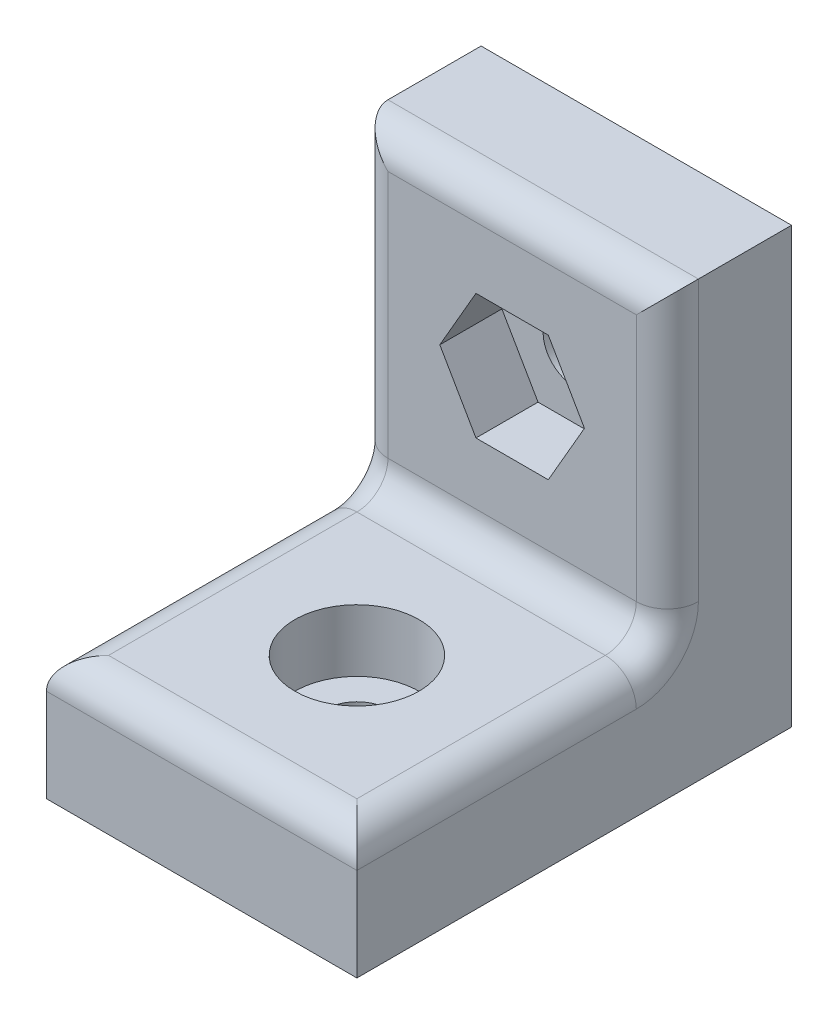
ISO-10303-21;
HEADER;
FILE_DESCRIPTION(('STEP AP214'),'2;1');
FILE_NAME('part.step','',(''),(''),'','','');
FILE_SCHEMA(('AUTOMOTIVE_DESIGN { 1 0 10303 214 1 1 1 1 }'));
ENDSEC;
DATA;
#1=APPLICATION_CONTEXT('core data for automotive mechanical design processes');
#2=APPLICATION_PROTOCOL_DEFINITION('international standard','automotive_design',2000,#1);
#3=PRODUCT_CONTEXT('',#1,'mechanical');
#4=PRODUCT('Part','Part','',(#3));
#5=PRODUCT_RELATED_PRODUCT_CATEGORY('part','',(#4));
#6=PRODUCT_DEFINITION_FORMATION('','',#4);
#7=PRODUCT_DEFINITION_CONTEXT('part definition',#1,'design');
#8=PRODUCT_DEFINITION('design','',#6,#7);
#9=PRODUCT_DEFINITION_SHAPE('','',#8);
#10=(LENGTH_UNIT() NAMED_UNIT(*) SI_UNIT(.MILLI.,.METRE.));
#11=(NAMED_UNIT(*) PLANE_ANGLE_UNIT() SI_UNIT($,.RADIAN.));
#12=(NAMED_UNIT(*) SI_UNIT($,.STERADIAN.) SOLID_ANGLE_UNIT());
#13=UNCERTAINTY_MEASURE_WITH_UNIT(LENGTH_MEASURE(1.E-05),#10,'distance_accuracy_value','');
#14=(GEOMETRIC_REPRESENTATION_CONTEXT(3) GLOBAL_UNCERTAINTY_ASSIGNED_CONTEXT((#13)) GLOBAL_UNIT_ASSIGNED_CONTEXT((#10,
#11,#12)) REPRESENTATION_CONTEXT('',''));
#15=CARTESIAN_POINT('',(0.,0.,0.));
#16=DIRECTION('',(0.,0.,1.));
#17=DIRECTION('',(1.,0.,0.));
#18=AXIS2_PLACEMENT_3D('',#15,#16,#17);
#19=CARTESIAN_POINT('',(0.,0.,9.));
#20=DIRECTION('',(0.,1.,0.));
#21=DIRECTION('',(0.,0.,1.));
#22=AXIS2_PLACEMENT_3D('',#19,#20,#21);
#23=CYLINDRICAL_SURFACE('',#22,1.);
#24=CARTESIAN_POINT('',(0.,0.,9.));
#25=DIRECTION('',(0.,1.,0.));
#26=DIRECTION('',(0.,0.,1.));
#27=AXIS2_PLACEMENT_3D('',#24,#25,#26);
#28=CIRCLE('',#27,1.);
#29=CARTESIAN_POINT('',(0.,0.,10.));
#30=VERTEX_POINT('',#29);
#31=EDGE_CURVE('E220',#30,#30,#28,.T.);
#32=ORIENTED_EDGE('',*,*,#31,.F.);
#33=EDGE_LOOP('',(#32));
#34=FACE_BOUND('',#33,.T.);
#35=CARTESIAN_POINT('',(0.,2.,9.));
#36=DIRECTION('',(0.,1.,0.));
#37=DIRECTION('',(0.,0.,1.));
#38=AXIS2_PLACEMENT_3D('',#35,#36,#37);
#39=CIRCLE('',#38,1.);
#40=CARTESIAN_POINT('',(0.,2.,10.));
#41=VERTEX_POINT('',#40);
#42=EDGE_CURVE('E44',#41,#41,#39,.F.);
#43=ORIENTED_EDGE('',*,*,#42,.F.);
#44=EDGE_LOOP('',(#43));
#45=FACE_BOUND('',#44,.T.);
#46=ADVANCED_FACE('F40',(#34,#45),#23,.F.);
#47=CARTESIAN_POINT('',(0.,9.,0.));
#48=DIRECTION('',(0.,0.,1.));
#49=DIRECTION('',(1.,0.,0.));
#50=AXIS2_PLACEMENT_3D('',#47,#48,#49);
#51=CYLINDRICAL_SURFACE('',#50,1.);
#52=CARTESIAN_POINT('',(0.,9.,0.));
#53=DIRECTION('',(0.,0.,1.));
#54=DIRECTION('',(1.,0.,0.));
#55=AXIS2_PLACEMENT_3D('',#52,#53,#54);
#56=CIRCLE('',#55,1.);
#57=CARTESIAN_POINT('',(1.,9.,0.));
#58=VERTEX_POINT('',#57);
#59=EDGE_CURVE('E224',#58,#58,#56,.T.);
#60=ORIENTED_EDGE('',*,*,#59,.F.);
#61=EDGE_LOOP('',(#60));
#62=FACE_BOUND('',#61,.T.);
#63=CARTESIAN_POINT('',(0.,9.,2.));
#64=DIRECTION('',(0.,0.,1.));
#65=DIRECTION('',(1.,0.,0.));
#66=AXIS2_PLACEMENT_3D('',#63,#64,#65);
#67=CIRCLE('',#66,1.);
#68=CARTESIAN_POINT('',(1.,9.,2.));
#69=VERTEX_POINT('',#68);
#70=EDGE_CURVE('E212',#69,#69,#67,.F.);
#71=ORIENTED_EDGE('',*,*,#70,.F.);
#72=EDGE_LOOP('',(#71));
#73=FACE_BOUND('',#72,.T.);
#74=ADVANCED_FACE('F317',(#62,#73),#51,.F.);
#75=CARTESIAN_POINT('',(-5.,14.,4.));
#76=DIRECTION('',(1.,0.,0.));
#77=DIRECTION('',(0.,1.,0.));
#78=AXIS2_PLACEMENT_3D('',#75,#76,#77);
#79=PLANE('',#78);
#80=CARTESIAN_POINT('',(-5.,5.,5.));
#81=DIRECTION('',(1.,0.,0.));
#82=DIRECTION('',(0.,1.,0.));
#83=AXIS2_PLACEMENT_3D('',#80,#81,#82);
#84=CIRCLE('',#83,2.);
#85=CARTESIAN_POINT('',(-5.,5.,3.));
#86=VERTEX_POINT('',#85);
#87=CARTESIAN_POINT('',(-5.,3.,5.));
#88=VERTEX_POINT('',#87);
#89=EDGE_CURVE('E274',#86,#88,#84,.F.);
#90=ORIENTED_EDGE('',*,*,#89,.F.);
#91=DIRECTION('',(0.,-1.,0.));
#92=VECTOR('',#91,1.);
#93=CARTESIAN_POINT('',(-5.,14.,3.));
#94=LINE('',#93,#92);
#95=CARTESIAN_POINT('',(-5.,14.,3.));
#96=VERTEX_POINT('',#95);
#97=EDGE_CURVE('E279',#86,#96,#94,.F.);
#98=ORIENTED_EDGE('',*,*,#97,.T.);
#99=DIRECTION('',(0.,0.,-1.));
#100=VECTOR('',#99,1.);
#101=CARTESIAN_POINT('',(-5.,14.,4.));
#102=LINE('',#101,#100);
#103=CARTESIAN_POINT('',(-5.,14.,0.));
#104=VERTEX_POINT('',#103);
#105=EDGE_CURVE('E247',#96,#104,#102,.T.);
#106=ORIENTED_EDGE('',*,*,#105,.T.);
#107=DIRECTION('',(0.,-1.,0.));
#108=VECTOR('',#107,1.);
#109=CARTESIAN_POINT('',(-5.,14.,0.));
#110=LINE('',#109,#108);
#111=CARTESIAN_POINT('',(-5.,0.,0.));
#112=VERTEX_POINT('',#111);
#113=EDGE_CURVE('E236',#104,#112,#110,.T.);
#114=ORIENTED_EDGE('',*,*,#113,.T.);
#115=DIRECTION('',(0.,0.,-1.));
#116=VECTOR('',#115,1.);
#117=CARTESIAN_POINT('',(-5.,0.,4.));
#118=LINE('',#117,#116);
#119=CARTESIAN_POINT('',(-5.,0.,14.));
#120=VERTEX_POINT('',#119);
#121=EDGE_CURVE('E254',#120,#112,#118,.T.);
#122=ORIENTED_EDGE('',*,*,#121,.F.);
#123=DIRECTION('',(0.,-1.,0.));
#124=VECTOR('',#123,1.);
#125=CARTESIAN_POINT('',(-5.,0.,14.));
#126=LINE('',#125,#124);
#127=CARTESIAN_POINT('',(-5.,3.,14.));
#128=VERTEX_POINT('',#127);
#129=EDGE_CURVE('E227',#128,#120,#126,.T.);
#130=ORIENTED_EDGE('',*,*,#129,.F.);
#131=DIRECTION('',(0.,0.,-1.));
#132=VECTOR('',#131,1.);
#133=CARTESIAN_POINT('',(-5.,3.,4.));
#134=LINE('',#133,#132);
#135=EDGE_CURVE('E277',#128,#88,#134,.T.);
#136=ORIENTED_EDGE('',*,*,#135,.T.);
#137=EDGE_LOOP('',(#90,#98,#106,#114,#122,#130,#136));
#138=FACE_BOUND('',#137,.T.);
#139=ADVANCED_FACE('F319',(#138),#79,.F.);
#140=CARTESIAN_POINT('',(-5.,0.,4.));
#141=DIRECTION('',(0.,1.,0.));
#142=DIRECTION('',(0.,0.,1.));
#143=AXIS2_PLACEMENT_3D('',#140,#141,#142);
#144=PLANE('',#143);
#145=ORIENTED_EDGE('',*,*,#31,.T.);
#146=EDGE_LOOP('',(#145));
#147=FACE_BOUND('',#146,.T.);
#148=DIRECTION('',(1.,0.,0.));
#149=VECTOR('',#148,1.);
#150=CARTESIAN_POINT('',(-5.,0.,0.));
#151=LINE('',#150,#149);
#152=CARTESIAN_POINT('',(5.,0.,0.));
#153=VERTEX_POINT('',#152);
#154=EDGE_CURVE('E239',#112,#153,#151,.T.);
#155=ORIENTED_EDGE('',*,*,#154,.T.);
#156=DIRECTION('',(0.,0.,-1.));
#157=VECTOR('',#156,1.);
#158=CARTESIAN_POINT('',(5.,0.,4.));
#159=LINE('',#158,#157);
#160=CARTESIAN_POINT('',(5.,0.,14.));
#161=VERTEX_POINT('',#160);
#162=EDGE_CURVE('E251',#161,#153,#159,.T.);
#163=ORIENTED_EDGE('',*,*,#162,.F.);
#164=DIRECTION('',(1.,0.,0.));
#165=VECTOR('',#164,1.);
#166=CARTESIAN_POINT('',(-5.,0.,14.));
#167=LINE('',#166,#165);
#168=EDGE_CURVE('E230',#120,#161,#167,.T.);
#169=ORIENTED_EDGE('',*,*,#168,.F.);
#170=ORIENTED_EDGE('',*,*,#121,.T.);
#171=EDGE_LOOP('',(#155,#163,#169,#170));
#172=FACE_BOUND('',#171,.T.);
#173=ADVANCED_FACE('F326',(#147,#172),#144,.F.);
#174=CARTESIAN_POINT('',(5.,14.,4.));
#175=DIRECTION('',(-1.,0.,0.));
#176=DIRECTION('',(0.,-1.,0.));
#177=AXIS2_PLACEMENT_3D('',#174,#175,#176);
#178=PLANE('',#177);
#179=DIRECTION('',(0.,0.,-1.));
#180=VECTOR('',#179,1.);
#181=CARTESIAN_POINT('',(5.,14.,4.));
#182=LINE('',#181,#180);
#183=CARTESIAN_POINT('',(5.,14.,3.));
#184=VERTEX_POINT('',#183);
#185=CARTESIAN_POINT('',(5.,14.,0.));
#186=VERTEX_POINT('',#185);
#187=EDGE_CURVE('E249',#184,#186,#182,.T.);
#188=ORIENTED_EDGE('',*,*,#187,.F.);
#189=DIRECTION('',(0.,1.,0.));
#190=VECTOR('',#189,1.);
#191=CARTESIAN_POINT('',(5.,4.,3.));
#192=LINE('',#191,#190);
#193=CARTESIAN_POINT('',(5.,5.,3.));
#194=VERTEX_POINT('',#193);
#195=EDGE_CURVE('E271',#184,#194,#192,.F.);
#196=ORIENTED_EDGE('',*,*,#195,.T.);
#197=CARTESIAN_POINT('',(5.,5.,5.));
#198=DIRECTION('',(-1.,0.,0.));
#199=DIRECTION('',(0.,-1.,0.));
#200=AXIS2_PLACEMENT_3D('',#197,#198,#199);
#201=CIRCLE('',#200,2.);
#202=CARTESIAN_POINT('',(5.,3.,5.));
#203=VERTEX_POINT('',#202);
#204=EDGE_CURVE('E268',#203,#194,#201,.F.);
#205=ORIENTED_EDGE('',*,*,#204,.F.);
#206=DIRECTION('',(0.,0.,-1.));
#207=VECTOR('',#206,1.);
#208=CARTESIAN_POINT('',(5.,3.,4.));
#209=LINE('',#208,#207);
#210=CARTESIAN_POINT('',(5.,3.,14.));
#211=VERTEX_POINT('',#210);
#212=EDGE_CURVE('E266',#203,#211,#209,.F.);
#213=ORIENTED_EDGE('',*,*,#212,.T.);
#214=DIRECTION('',(0.,1.,0.));
#215=VECTOR('',#214,1.);
#216=CARTESIAN_POINT('',(5.,0.,14.));
#217=LINE('',#216,#215);
#218=EDGE_CURVE('E233',#161,#211,#217,.T.);
#219=ORIENTED_EDGE('',*,*,#218,.F.);
#220=ORIENTED_EDGE('',*,*,#162,.T.);
#221=DIRECTION('',(0.,1.,0.));
#222=VECTOR('',#221,1.);
#223=CARTESIAN_POINT('',(5.,14.,0.));
#224=LINE('',#223,#222);
#225=EDGE_CURVE('E241',#153,#186,#224,.T.);
#226=ORIENTED_EDGE('',*,*,#225,.T.);
#227=EDGE_LOOP('',(#188,#196,#205,#213,#219,#220,#226));
#228=FACE_BOUND('',#227,.T.);
#229=ADVANCED_FACE('F353',(#228),#178,.F.);
#230=CARTESIAN_POINT('',(-5.,14.,4.));
#231=DIRECTION('',(0.,-1.,0.));
#232=DIRECTION('',(0.,0.,-1.));
#233=AXIS2_PLACEMENT_3D('',#230,#231,#232);
#234=PLANE('',#233);
#235=ORIENTED_EDGE('',*,*,#105,.F.);
#236=DIRECTION('',(-1.,0.,0.));
#237=VECTOR('',#236,1.);
#238=CARTESIAN_POINT('',(5.,14.,3.));
#239=LINE('',#238,#237);
#240=EDGE_CURVE('E281',#96,#184,#239,.F.);
#241=ORIENTED_EDGE('',*,*,#240,.T.);
#242=ORIENTED_EDGE('',*,*,#187,.T.);
#243=DIRECTION('',(-1.,0.,0.));
#244=VECTOR('',#243,1.);
#245=CARTESIAN_POINT('',(-5.,14.,0.));
#246=LINE('',#245,#244);
#247=EDGE_CURVE('E244',#186,#104,#246,.T.);
#248=ORIENTED_EDGE('',*,*,#247,.T.);
#249=EDGE_LOOP('',(#235,#241,#242,#248));
#250=FACE_BOUND('',#249,.T.);
#251=ADVANCED_FACE('F346',(#250),#234,.F.);
#252=CARTESIAN_POINT('',(0.,0.,4.));
#253=DIRECTION('',(0.,0.,1.));
#254=DIRECTION('',(1.,0.,0.));
#255=AXIS2_PLACEMENT_3D('',#252,#253,#254);
#256=PLANE('',#255);
#257=DIRECTION('',(1.,0.,0.));
#258=VECTOR('',#257,1.);
#259=CARTESIAN_POINT('',(-1.165,6.98216080918226,4.));
#260=LINE('',#259,#258);
#261=CARTESIAN_POINT('',(-1.165,6.98216080918226,4.));
#262=VERTEX_POINT('',#261);
#263=CARTESIAN_POINT('',(1.165,6.98216080918226,4.));
#264=VERTEX_POINT('',#263);
#265=EDGE_CURVE('E57',#262,#264,#260,.T.);
#266=ORIENTED_EDGE('',*,*,#265,.F.);
#267=DIRECTION('',(0.5,-0.866025403784439,0.));
#268=VECTOR('',#267,1.);
#269=CARTESIAN_POINT('',(-2.33,9.,4.));
#270=LINE('',#269,#268);
#271=CARTESIAN_POINT('',(-2.33,9.,4.));
#272=VERTEX_POINT('',#271);
#273=EDGE_CURVE('E183',#272,#262,#270,.T.);
#274=ORIENTED_EDGE('',*,*,#273,.F.);
#275=DIRECTION('',(-0.5,-0.866025403784439,0.));
#276=VECTOR('',#275,1.);
#277=CARTESIAN_POINT('',(-1.165,11.0178391908177,4.));
#278=LINE('',#277,#276);
#279=CARTESIAN_POINT('',(-1.165,11.0178391908177,4.));
#280=VERTEX_POINT('',#279);
#281=EDGE_CURVE('E186',#280,#272,#278,.T.);
#282=ORIENTED_EDGE('',*,*,#281,.F.);
#283=DIRECTION('',(-1.,0.,0.));
#284=VECTOR('',#283,1.);
#285=CARTESIAN_POINT('',(1.165,11.0178391908177,4.));
#286=LINE('',#285,#284);
#287=CARTESIAN_POINT('',(1.165,11.0178391908177,4.));
#288=VERTEX_POINT('',#287);
#289=EDGE_CURVE('E205',#288,#280,#286,.T.);
#290=ORIENTED_EDGE('',*,*,#289,.F.);
#291=DIRECTION('',(-0.5,0.866025403784439,0.));
#292=VECTOR('',#291,1.);
#293=CARTESIAN_POINT('',(2.33,9.,4.));
#294=LINE('',#293,#292);
#295=CARTESIAN_POINT('',(2.33,9.,4.));
#296=VERTEX_POINT('',#295);
#297=EDGE_CURVE('E202',#296,#288,#294,.T.);
#298=ORIENTED_EDGE('',*,*,#297,.F.);
#299=DIRECTION('',(0.5,0.866025403784439,0.));
#300=VECTOR('',#299,1.);
#301=CARTESIAN_POINT('',(1.165,6.98216080918226,4.));
#302=LINE('',#301,#300);
#303=EDGE_CURVE('E200',#264,#296,#302,.T.);
#304=ORIENTED_EDGE('',*,*,#303,.F.);
#305=EDGE_LOOP('',(#266,#274,#282,#290,#298,#304));
#306=FACE_BOUND('',#305,.T.);
#307=DIRECTION('',(0.,1.,0.));
#308=VECTOR('',#307,1.);
#309=CARTESIAN_POINT('',(4.,14.,4.));
#310=LINE('',#309,#308);
#311=CARTESIAN_POINT('',(4.,5.,4.));
#312=VERTEX_POINT('',#311);
#313=CARTESIAN_POINT('',(4.,13.,4.));
#314=VERTEX_POINT('',#313);
#315=EDGE_CURVE('E261',#312,#314,#310,.T.);
#316=ORIENTED_EDGE('',*,*,#315,.T.);
#317=DIRECTION('',(-1.,0.,0.));
#318=VECTOR('',#317,1.);
#319=CARTESIAN_POINT('',(-5.,13.,4.));
#320=LINE('',#319,#318);
#321=CARTESIAN_POINT('',(-4.,13.,4.));
#322=VERTEX_POINT('',#321);
#323=EDGE_CURVE('E264',#314,#322,#320,.T.);
#324=ORIENTED_EDGE('',*,*,#323,.T.);
#325=DIRECTION('',(0.,-1.,0.));
#326=VECTOR('',#325,1.);
#327=CARTESIAN_POINT('',(-4.,4.,4.));
#328=LINE('',#327,#326);
#329=CARTESIAN_POINT('',(-4.,5.,4.));
#330=VERTEX_POINT('',#329);
#331=EDGE_CURVE('E259',#322,#330,#328,.T.);
#332=ORIENTED_EDGE('',*,*,#331,.T.);
#333=DIRECTION('',(-1.,0.,0.));
#334=VECTOR('',#333,1.);
#335=CARTESIAN_POINT('',(0.,5.,4.));
#336=LINE('',#335,#334);
#337=EDGE_CURVE('E257',#330,#312,#336,.F.);
#338=ORIENTED_EDGE('',*,*,#337,.T.);
#339=EDGE_LOOP('',(#316,#324,#332,#338));
#340=FACE_BOUND('',#339,.T.);
#341=ADVANCED_FACE('F343',(#306,#340),#256,.T.);
#342=CARTESIAN_POINT('',(0.,0.,0.));
#343=DIRECTION('',(0.,0.,1.));
#344=DIRECTION('',(1.,0.,0.));
#345=AXIS2_PLACEMENT_3D('',#342,#343,#344);
#346=PLANE('',#345);
#347=ORIENTED_EDGE('',*,*,#59,.T.);
#348=EDGE_LOOP('',(#347));
#349=FACE_BOUND('',#348,.T.);
#350=ORIENTED_EDGE('',*,*,#113,.F.);
#351=ORIENTED_EDGE('',*,*,#247,.F.);
#352=ORIENTED_EDGE('',*,*,#225,.F.);
#353=ORIENTED_EDGE('',*,*,#154,.F.);
#354=EDGE_LOOP('',(#350,#351,#352,#353));
#355=FACE_BOUND('',#354,.T.);
#356=ADVANCED_FACE('F341',(#349,#355),#346,.F.);
#357=CARTESIAN_POINT('',(-5.,4.,14.));
#358=DIRECTION('',(0.,-1.,0.));
#359=DIRECTION('',(0.,0.,-1.));
#360=AXIS2_PLACEMENT_3D('',#357,#358,#359);
#361=PLANE('',#360);
#362=CARTESIAN_POINT('',(0.,4.,9.));
#363=DIRECTION('',(0.,1.,0.));
#364=DIRECTION('',(0.,0.,1.));
#365=AXIS2_PLACEMENT_3D('',#362,#363,#364);
#366=CIRCLE('',#365,2.);
#367=CARTESIAN_POINT('',(0.,4.,11.));
#368=VERTEX_POINT('',#367);
#369=EDGE_CURVE('E189',#368,#368,#366,.T.);
#370=ORIENTED_EDGE('',*,*,#369,.F.);
#371=EDGE_LOOP('',(#370));
#372=FACE_BOUND('',#371,.T.);
#373=DIRECTION('',(0.,0.,-1.));
#374=VECTOR('',#373,1.);
#375=CARTESIAN_POINT('',(-4.,4.,14.));
#376=LINE('',#375,#374);
#377=CARTESIAN_POINT('',(-4.,4.,5.));
#378=VERTEX_POINT('',#377);
#379=CARTESIAN_POINT('',(-4.,4.,13.));
#380=VERTEX_POINT('',#379);
#381=EDGE_CURVE('E287',#378,#380,#376,.F.);
#382=ORIENTED_EDGE('',*,*,#381,.T.);
#383=DIRECTION('',(-1.,0.,0.));
#384=VECTOR('',#383,1.);
#385=CARTESIAN_POINT('',(-5.,4.,13.));
#386=LINE('',#385,#384);
#387=CARTESIAN_POINT('',(4.,4.,13.));
#388=VERTEX_POINT('',#387);
#389=EDGE_CURVE('E12',#380,#388,#386,.F.);
#390=ORIENTED_EDGE('',*,*,#389,.T.);
#391=DIRECTION('',(0.,0.,-1.));
#392=VECTOR('',#391,1.);
#393=CARTESIAN_POINT('',(4.,4.,14.));
#394=LINE('',#393,#392);
#395=CARTESIAN_POINT('',(4.,4.,5.));
#396=VERTEX_POINT('',#395);
#397=EDGE_CURVE('E49',#388,#396,#394,.T.);
#398=ORIENTED_EDGE('',*,*,#397,.T.);
#399=DIRECTION('',(-1.,0.,0.));
#400=VECTOR('',#399,1.);
#401=CARTESIAN_POINT('',(-5.,4.,5.));
#402=LINE('',#401,#400);
#403=EDGE_CURVE('E285',#396,#378,#402,.T.);
#404=ORIENTED_EDGE('',*,*,#403,.T.);
#405=EDGE_LOOP('',(#382,#390,#398,#404));
#406=FACE_BOUND('',#405,.T.);
#407=ADVANCED_FACE('F337',(#372,#406),#361,.F.);
#408=CARTESIAN_POINT('',(0.,0.,14.));
#409=DIRECTION('',(0.,0.,-1.));
#410=DIRECTION('',(-1.,0.,0.));
#411=AXIS2_PLACEMENT_3D('',#408,#409,#410);
#412=PLANE('',#411);
#413=ORIENTED_EDGE('',*,*,#218,.T.);
#414=DIRECTION('',(-1.,0.,0.));
#415=VECTOR('',#414,1.);
#416=CARTESIAN_POINT('',(0.,3.,14.));
#417=LINE('',#416,#415);
#418=EDGE_CURVE('E283',#211,#128,#417,.T.);
#419=ORIENTED_EDGE('',*,*,#418,.T.);
#420=ORIENTED_EDGE('',*,*,#129,.T.);
#421=ORIENTED_EDGE('',*,*,#168,.T.);
#422=EDGE_LOOP('',(#413,#419,#420,#421));
#423=FACE_BOUND('',#422,.T.);
#424=ADVANCED_FACE('F334',(#423),#412,.F.);
#425=CARTESIAN_POINT('',(-4.,3.,4.));
#426=DIRECTION('',(0.,0.,-1.));
#427=DIRECTION('',(-1.,0.,0.));
#428=AXIS2_PLACEMENT_3D('',#425,#426,#427);
#429=CYLINDRICAL_SURFACE('',#428,1.);
#430=CARTESIAN_POINT('',(-4.,3.,5.));
#431=DIRECTION('',(0.,0.,-1.));
#432=DIRECTION('',(-1.,0.,0.));
#433=AXIS2_PLACEMENT_3D('',#430,#431,#432);
#434=CIRCLE('',#433,1.);
#435=EDGE_CURVE('E310',#88,#378,#434,.T.);
#436=ORIENTED_EDGE('',*,*,#435,.F.);
#437=ORIENTED_EDGE('',*,*,#135,.F.);
#438=CARTESIAN_POINT('',(-4.,3.,13.));
#439=DIRECTION('',(-0.707106781186547,0.,-0.707106781186547));
#440=DIRECTION('',(0.707106781186547,0.,-0.707106781186547));
#441=AXIS2_PLACEMENT_3D('',#438,#439,#440);
#442=ELLIPSE('',#441,1.41421356237309,1.);
#443=EDGE_CURVE('E228',#380,#128,#442,.F.);
#444=ORIENTED_EDGE('',*,*,#443,.F.);
#445=ORIENTED_EDGE('',*,*,#381,.F.);
#446=EDGE_LOOP('',(#436,#437,#444,#445));
#447=FACE_BOUND('',#446,.T.);
#448=ADVANCED_FACE('F42',(#447),#429,.T.);
#449=CARTESIAN_POINT('',(0.,3.,13.));
#450=DIRECTION('',(-1.,0.,0.));
#451=DIRECTION('',(0.,0.,1.));
#452=AXIS2_PLACEMENT_3D('',#449,#450,#451);
#453=CYLINDRICAL_SURFACE('',#452,1.);
#454=ORIENTED_EDGE('',*,*,#443,.T.);
#455=ORIENTED_EDGE('',*,*,#418,.F.);
#456=CARTESIAN_POINT('',(4.,3.,13.));
#457=DIRECTION('',(0.707106781186547,0.,-0.707106781186547));
#458=DIRECTION('',(-0.707106781186547,0.,-0.707106781186547));
#459=AXIS2_PLACEMENT_3D('',#456,#457,#458);
#460=ELLIPSE('',#459,1.41421356237309,1.);
#461=EDGE_CURVE('E308',#388,#211,#460,.T.);
#462=ORIENTED_EDGE('',*,*,#461,.F.);
#463=ORIENTED_EDGE('',*,*,#389,.F.);
#464=EDGE_LOOP('',(#454,#455,#462,#463));
#465=FACE_BOUND('',#464,.T.);
#466=ADVANCED_FACE('F386',(#465),#453,.T.);
#467=CARTESIAN_POINT('',(-4.,5.,5.));
#468=DIRECTION('',(1.,0.,0.));
#469=DIRECTION('',(0.,1.,0.));
#470=AXIS2_PLACEMENT_3D('',#467,#468,#469);
#471=TOROIDAL_SURFACE('',#470,2.,1.);
#472=ORIENTED_EDGE('',*,*,#89,.T.);
#473=ORIENTED_EDGE('',*,*,#435,.T.);
#474=CARTESIAN_POINT('',(-4.,5.,5.));
#475=DIRECTION('',(1.,0.,0.));
#476=DIRECTION('',(0.,1.,0.));
#477=AXIS2_PLACEMENT_3D('',#474,#475,#476);
#478=CIRCLE('',#477,1.);
#479=EDGE_CURVE('E305',#330,#378,#478,.F.);
#480=ORIENTED_EDGE('',*,*,#479,.F.);
#481=CARTESIAN_POINT('',(-4.,5.,3.));
#482=DIRECTION('',(0.,-1.,0.));
#483=DIRECTION('',(0.,0.,-1.));
#484=AXIS2_PLACEMENT_3D('',#481,#482,#483);
#485=CIRCLE('',#484,1.);
#486=EDGE_CURVE('E302',#86,#330,#485,.F.);
#487=ORIENTED_EDGE('',*,*,#486,.F.);
#488=EDGE_LOOP('',(#472,#473,#480,#487));
#489=FACE_BOUND('',#488,.T.);
#490=ADVANCED_FACE('F384',(#489),#471,.T.);
#491=CARTESIAN_POINT('',(4.,3.,14.));
#492=DIRECTION('',(0.,0.,-1.));
#493=DIRECTION('',(-1.,0.,0.));
#494=AXIS2_PLACEMENT_3D('',#491,#492,#493);
#495=CYLINDRICAL_SURFACE('',#494,1.);
#496=ORIENTED_EDGE('',*,*,#461,.T.);
#497=ORIENTED_EDGE('',*,*,#212,.F.);
#498=CARTESIAN_POINT('',(4.,3.,5.));
#499=DIRECTION('',(0.,0.,-1.));
#500=DIRECTION('',(-1.,0.,0.));
#501=AXIS2_PLACEMENT_3D('',#498,#499,#500);
#502=CIRCLE('',#501,1.);
#503=EDGE_CURVE('E299',#396,#203,#502,.T.);
#504=ORIENTED_EDGE('',*,*,#503,.F.);
#505=ORIENTED_EDGE('',*,*,#397,.F.);
#506=EDGE_LOOP('',(#496,#497,#504,#505));
#507=FACE_BOUND('',#506,.T.);
#508=ADVANCED_FACE('F380',(#507),#495,.T.);
#509=CARTESIAN_POINT('',(-5.,5.,5.));
#510=DIRECTION('',(-1.,0.,0.));
#511=DIRECTION('',(0.,0.,1.));
#512=AXIS2_PLACEMENT_3D('',#509,#510,#511);
#513=CYLINDRICAL_SURFACE('',#512,1.);
#514=ORIENTED_EDGE('',*,*,#479,.T.);
#515=ORIENTED_EDGE('',*,*,#403,.F.);
#516=CARTESIAN_POINT('',(4.,5.,5.));
#517=DIRECTION('',(-1.,0.,0.));
#518=DIRECTION('',(0.,-1.,0.));
#519=AXIS2_PLACEMENT_3D('',#516,#517,#518);
#520=CIRCLE('',#519,1.);
#521=EDGE_CURVE('E296',#312,#396,#520,.T.);
#522=ORIENTED_EDGE('',*,*,#521,.F.);
#523=ORIENTED_EDGE('',*,*,#337,.F.);
#524=EDGE_LOOP('',(#514,#515,#522,#523));
#525=FACE_BOUND('',#524,.T.);
#526=ADVANCED_FACE('F376',(#525),#513,.F.);
#527=CARTESIAN_POINT('',(-4.,0.,3.));
#528=DIRECTION('',(0.,1.,0.));
#529=DIRECTION('',(-1.,0.,0.));
#530=AXIS2_PLACEMENT_3D('',#527,#528,#529);
#531=CYLINDRICAL_SURFACE('',#530,1.);
#532=ORIENTED_EDGE('',*,*,#486,.T.);
#533=ORIENTED_EDGE('',*,*,#331,.F.);
#534=CARTESIAN_POINT('',(-4.,13.,3.));
#535=DIRECTION('',(0.707106781186547,0.707106781186548,0.));
#536=DIRECTION('',(0.707106781186548,-0.707106781186547,0.));
#537=AXIS2_PLACEMENT_3D('',#534,#535,#536);
#538=ELLIPSE('',#537,1.4142135623731,1.);
#539=EDGE_CURVE('E293',#96,#322,#538,.T.);
#540=ORIENTED_EDGE('',*,*,#539,.F.);
#541=ORIENTED_EDGE('',*,*,#97,.F.);
#542=EDGE_LOOP('',(#532,#533,#540,#541));
#543=FACE_BOUND('',#542,.T.);
#544=ADVANCED_FACE('F372',(#543),#531,.T.);
#545=CARTESIAN_POINT('',(4.,5.,5.));
#546=DIRECTION('',(-1.,0.,0.));
#547=DIRECTION('',(0.,-1.,0.));
#548=AXIS2_PLACEMENT_3D('',#545,#546,#547);
#549=TOROIDAL_SURFACE('',#548,2.,1.);
#550=ORIENTED_EDGE('',*,*,#503,.T.);
#551=ORIENTED_EDGE('',*,*,#204,.T.);
#552=CARTESIAN_POINT('',(4.,5.,3.));
#553=DIRECTION('',(0.,-1.,0.));
#554=DIRECTION('',(0.,0.,-1.));
#555=AXIS2_PLACEMENT_3D('',#552,#553,#554);
#556=CIRCLE('',#555,1.);
#557=EDGE_CURVE('E291',#312,#194,#556,.F.);
#558=ORIENTED_EDGE('',*,*,#557,.F.);
#559=ORIENTED_EDGE('',*,*,#521,.T.);
#560=EDGE_LOOP('',(#550,#551,#558,#559));
#561=FACE_BOUND('',#560,.T.);
#562=ADVANCED_FACE('F368',(#561),#549,.T.);
#563=CARTESIAN_POINT('',(0.,13.,3.));
#564=DIRECTION('',(1.,0.,0.));
#565=DIRECTION('',(0.,0.,-1.));
#566=AXIS2_PLACEMENT_3D('',#563,#564,#565);
#567=CYLINDRICAL_SURFACE('',#566,1.);
#568=ORIENTED_EDGE('',*,*,#539,.T.);
#569=ORIENTED_EDGE('',*,*,#323,.F.);
#570=CARTESIAN_POINT('',(4.,13.,3.));
#571=DIRECTION('',(0.707106781186548,-0.707106781186547,0.));
#572=DIRECTION('',(0.707106781186547,0.707106781186548,0.));
#573=AXIS2_PLACEMENT_3D('',#570,#571,#572);
#574=ELLIPSE('',#573,1.41421356237309,1.);
#575=EDGE_CURVE('E223',#184,#314,#574,.T.);
#576=ORIENTED_EDGE('',*,*,#575,.F.);
#577=ORIENTED_EDGE('',*,*,#240,.F.);
#578=EDGE_LOOP('',(#568,#569,#576,#577));
#579=FACE_BOUND('',#578,.T.);
#580=ADVANCED_FACE('F364',(#579),#567,.T.);
#581=CARTESIAN_POINT('',(4.,0.,3.));
#582=DIRECTION('',(0.,-1.,0.));
#583=DIRECTION('',(1.,0.,0.));
#584=AXIS2_PLACEMENT_3D('',#581,#582,#583);
#585=CYLINDRICAL_SURFACE('',#584,1.);
#586=ORIENTED_EDGE('',*,*,#557,.T.);
#587=ORIENTED_EDGE('',*,*,#195,.F.);
#588=ORIENTED_EDGE('',*,*,#575,.T.);
#589=ORIENTED_EDGE('',*,*,#315,.F.);
#590=EDGE_LOOP('',(#586,#587,#588,#589));
#591=FACE_BOUND('',#590,.T.);
#592=ADVANCED_FACE('F361',(#591),#585,.T.);
#593=CARTESIAN_POINT('',(0.,0.,2.));
#594=DIRECTION('',(0.,0.,1.));
#595=DIRECTION('',(1.,0.,0.));
#596=AXIS2_PLACEMENT_3D('',#593,#594,#595);
#597=PLANE('',#596);
#598=DIRECTION('',(1.,0.,0.));
#599=VECTOR('',#598,1.);
#600=CARTESIAN_POINT('',(-1.165,6.98216080918226,2.));
#601=LINE('',#600,#599);
#602=CARTESIAN_POINT('',(-1.165,6.98216080918226,2.));
#603=VERTEX_POINT('',#602);
#604=CARTESIAN_POINT('',(1.165,6.98216080918226,2.));
#605=VERTEX_POINT('',#604);
#606=EDGE_CURVE('E163',#603,#605,#601,.T.);
#607=ORIENTED_EDGE('',*,*,#606,.T.);
#608=DIRECTION('',(0.5,0.866025403784439,0.));
#609=VECTOR('',#608,1.);
#610=CARTESIAN_POINT('',(1.165,6.98216080918226,2.));
#611=LINE('',#610,#609);
#612=CARTESIAN_POINT('',(2.33,9.,2.));
#613=VERTEX_POINT('',#612);
#614=EDGE_CURVE('E172',#605,#613,#611,.T.);
#615=ORIENTED_EDGE('',*,*,#614,.T.);
#616=DIRECTION('',(-0.5,0.866025403784439,0.));
#617=VECTOR('',#616,1.);
#618=CARTESIAN_POINT('',(2.33,9.,2.));
#619=LINE('',#618,#617);
#620=CARTESIAN_POINT('',(1.165,11.0178391908177,2.));
#621=VERTEX_POINT('',#620);
#622=EDGE_CURVE('E177',#613,#621,#619,.T.);
#623=ORIENTED_EDGE('',*,*,#622,.T.);
#624=DIRECTION('',(-1.,0.,0.));
#625=VECTOR('',#624,1.);
#626=CARTESIAN_POINT('',(1.165,11.0178391908177,2.));
#627=LINE('',#626,#625);
#628=CARTESIAN_POINT('',(-1.165,11.0178391908177,2.));
#629=VERTEX_POINT('',#628);
#630=EDGE_CURVE('E193',#621,#629,#627,.T.);
#631=ORIENTED_EDGE('',*,*,#630,.T.);
#632=DIRECTION('',(-0.5,-0.866025403784439,0.));
#633=VECTOR('',#632,1.);
#634=CARTESIAN_POINT('',(-1.165,11.0178391908177,2.));
#635=LINE('',#634,#633);
#636=CARTESIAN_POINT('',(-2.33,9.,2.));
#637=VERTEX_POINT('',#636);
#638=EDGE_CURVE('E196',#629,#637,#635,.T.);
#639=ORIENTED_EDGE('',*,*,#638,.T.);
#640=DIRECTION('',(0.5,-0.866025403784439,0.));
#641=VECTOR('',#640,1.);
#642=CARTESIAN_POINT('',(-2.33,9.,2.));
#643=LINE('',#642,#641);
#644=EDGE_CURVE('E169',#637,#603,#643,.T.);
#645=ORIENTED_EDGE('',*,*,#644,.T.);
#646=EDGE_LOOP('',(#607,#615,#623,#631,#639,#645));
#647=FACE_BOUND('',#646,.T.);
#648=ORIENTED_EDGE('',*,*,#70,.T.);
#649=EDGE_LOOP('',(#648));
#650=FACE_BOUND('',#649,.T.);
#651=ADVANCED_FACE('F179',(#647,#650),#597,.T.);
#652=CARTESIAN_POINT('',(-1.165,6.98216080918226,2.));
#653=DIRECTION('',(0.,-1.,0.));
#654=DIRECTION('',(0.,0.,-1.));
#655=AXIS2_PLACEMENT_3D('',#652,#653,#654);
#656=PLANE('',#655);
#657=ORIENTED_EDGE('',*,*,#265,.T.);
#658=DIRECTION('',(0.,0.,1.));
#659=VECTOR('',#658,1.);
#660=CARTESIAN_POINT('',(1.165,6.98216080918226,2.));
#661=LINE('',#660,#659);
#662=EDGE_CURVE('E159',#605,#264,#661,.T.);
#663=ORIENTED_EDGE('',*,*,#662,.F.);
#664=ORIENTED_EDGE('',*,*,#606,.F.);
#665=DIRECTION('',(0.,0.,1.));
#666=VECTOR('',#665,1.);
#667=CARTESIAN_POINT('',(-1.165,6.98216080918226,2.));
#668=LINE('',#667,#666);
#669=EDGE_CURVE('E210',#603,#262,#668,.T.);
#670=ORIENTED_EDGE('',*,*,#669,.T.);
#671=EDGE_LOOP('',(#657,#663,#664,#670));
#672=FACE_BOUND('',#671,.T.);
#673=ADVANCED_FACE('F161',(#672),#656,.F.);
#674=CARTESIAN_POINT('',(-2.33,9.,2.));
#675=DIRECTION('',(-0.866025403784439,-0.5,0.));
#676=DIRECTION('',(0.5,-0.866025403784439,0.));
#677=AXIS2_PLACEMENT_3D('',#674,#675,#676);
#678=PLANE('',#677);
#679=ORIENTED_EDGE('',*,*,#273,.T.);
#680=ORIENTED_EDGE('',*,*,#669,.F.);
#681=ORIENTED_EDGE('',*,*,#644,.F.);
#682=DIRECTION('',(0.,0.,1.));
#683=VECTOR('',#682,1.);
#684=CARTESIAN_POINT('',(-2.33,9.,2.));
#685=LINE('',#684,#683);
#686=EDGE_CURVE('E213',#637,#272,#685,.T.);
#687=ORIENTED_EDGE('',*,*,#686,.T.);
#688=EDGE_LOOP('',(#679,#680,#681,#687));
#689=FACE_BOUND('',#688,.T.);
#690=ADVANCED_FACE('F549',(#689),#678,.F.);
#691=CARTESIAN_POINT('',(-1.165,11.0178391908177,2.));
#692=DIRECTION('',(-0.866025403784439,0.5,0.));
#693=DIRECTION('',(-0.5,-0.866025403784439,0.));
#694=AXIS2_PLACEMENT_3D('',#691,#692,#693);
#695=PLANE('',#694);
#696=ORIENTED_EDGE('',*,*,#281,.T.);
#697=ORIENTED_EDGE('',*,*,#686,.F.);
#698=ORIENTED_EDGE('',*,*,#638,.F.);
#699=DIRECTION('',(0.,0.,1.));
#700=VECTOR('',#699,1.);
#701=CARTESIAN_POINT('',(-1.165,11.0178391908177,2.));
#702=LINE('',#701,#700);
#703=EDGE_CURVE('E215',#629,#280,#702,.T.);
#704=ORIENTED_EDGE('',*,*,#703,.T.);
#705=EDGE_LOOP('',(#696,#697,#698,#704));
#706=FACE_BOUND('',#705,.T.);
#707=ADVANCED_FACE('F556',(#706),#695,.F.);
#708=CARTESIAN_POINT('',(1.165,11.0178391908177,2.));
#709=DIRECTION('',(0.,1.,0.));
#710=DIRECTION('',(0.,0.,1.));
#711=AXIS2_PLACEMENT_3D('',#708,#709,#710);
#712=PLANE('',#711);
#713=ORIENTED_EDGE('',*,*,#289,.T.);
#714=ORIENTED_EDGE('',*,*,#703,.F.);
#715=ORIENTED_EDGE('',*,*,#630,.F.);
#716=DIRECTION('',(0.,0.,1.));
#717=VECTOR('',#716,1.);
#718=CARTESIAN_POINT('',(1.165,11.0178391908177,2.));
#719=LINE('',#718,#717);
#720=EDGE_CURVE('E217',#621,#288,#719,.T.);
#721=ORIENTED_EDGE('',*,*,#720,.T.);
#722=EDGE_LOOP('',(#713,#714,#715,#721));
#723=FACE_BOUND('',#722,.T.);
#724=ADVANCED_FACE('F565',(#723),#712,.F.);
#725=CARTESIAN_POINT('',(2.33,9.,2.));
#726=DIRECTION('',(0.866025403784439,0.5,0.));
#727=DIRECTION('',(-0.5,0.866025403784439,0.));
#728=AXIS2_PLACEMENT_3D('',#725,#726,#727);
#729=PLANE('',#728);
#730=ORIENTED_EDGE('',*,*,#297,.T.);
#731=ORIENTED_EDGE('',*,*,#720,.F.);
#732=ORIENTED_EDGE('',*,*,#622,.F.);
#733=DIRECTION('',(0.,0.,1.));
#734=VECTOR('',#733,1.);
#735=CARTESIAN_POINT('',(2.33,9.,2.));
#736=LINE('',#735,#734);
#737=EDGE_CURVE('E168',#613,#296,#736,.T.);
#738=ORIENTED_EDGE('',*,*,#737,.T.);
#739=EDGE_LOOP('',(#730,#731,#732,#738));
#740=FACE_BOUND('',#739,.T.);
#741=ADVANCED_FACE('F574',(#740),#729,.F.);
#742=CARTESIAN_POINT('',(1.165,6.98216080918226,2.));
#743=DIRECTION('',(0.866025403784439,-0.5,0.));
#744=DIRECTION('',(0.5,0.866025403784439,0.));
#745=AXIS2_PLACEMENT_3D('',#742,#743,#744);
#746=PLANE('',#745);
#747=ORIENTED_EDGE('',*,*,#303,.T.);
#748=ORIENTED_EDGE('',*,*,#737,.F.);
#749=ORIENTED_EDGE('',*,*,#614,.F.);
#750=ORIENTED_EDGE('',*,*,#662,.T.);
#751=EDGE_LOOP('',(#747,#748,#749,#750));
#752=FACE_BOUND('',#751,.T.);
#753=ADVANCED_FACE('F173',(#752),#746,.F.);
#754=CARTESIAN_POINT('',(0.,2.,9.));
#755=DIRECTION('',(0.,1.,0.));
#756=DIRECTION('',(0.,0.,1.));
#757=AXIS2_PLACEMENT_3D('',#754,#755,#756);
#758=PLANE('',#757);
#759=CARTESIAN_POINT('',(0.,2.,9.));
#760=DIRECTION('',(0.,1.,0.));
#761=DIRECTION('',(0.,0.,1.));
#762=AXIS2_PLACEMENT_3D('',#759,#760,#761);
#763=CIRCLE('',#762,2.);
#764=CARTESIAN_POINT('',(0.,2.,11.));
#765=VERTEX_POINT('',#764);
#766=EDGE_CURVE('E632',#765,#765,#763,.T.);
#767=ORIENTED_EDGE('',*,*,#766,.T.);
#768=EDGE_LOOP('',(#767));
#769=FACE_BOUND('',#768,.T.);
#770=ORIENTED_EDGE('',*,*,#42,.T.);
#771=EDGE_LOOP('',(#770));
#772=FACE_BOUND('',#771,.T.);
#773=ADVANCED_FACE('F591',(#769,#772),#758,.T.);
#774=CARTESIAN_POINT('',(0.,2.,9.));
#775=DIRECTION('',(0.,1.,0.));
#776=DIRECTION('',(0.,0.,1.));
#777=AXIS2_PLACEMENT_3D('',#774,#775,#776);
#778=CYLINDRICAL_SURFACE('',#777,2.);
#779=ORIENTED_EDGE('',*,*,#766,.F.);
#780=EDGE_LOOP('',(#779));
#781=FACE_BOUND('',#780,.T.);
#782=ORIENTED_EDGE('',*,*,#369,.T.);
#783=EDGE_LOOP('',(#782));
#784=FACE_BOUND('',#783,.T.);
#785=ADVANCED_FACE('F602',(#781,#784),#778,.F.);
#786=CLOSED_SHELL('',(#46,#74,#139,#173,#229,#251,#341,#356,#407,#424,#448,#466,#490,#508,#526,
#544,#562,#580,#592,#651,#673,#690,#707,#724,#741,#753,#773,#785));
#787=MANIFOLD_SOLID_BREP('B2',#786);
#788=ADVANCED_BREP_SHAPE_REPRESENTATION('',(#18,#787),#14);
#789=SHAPE_DEFINITION_REPRESENTATION(#9,#788);
ENDSEC;
END-ISO-10303-21;
